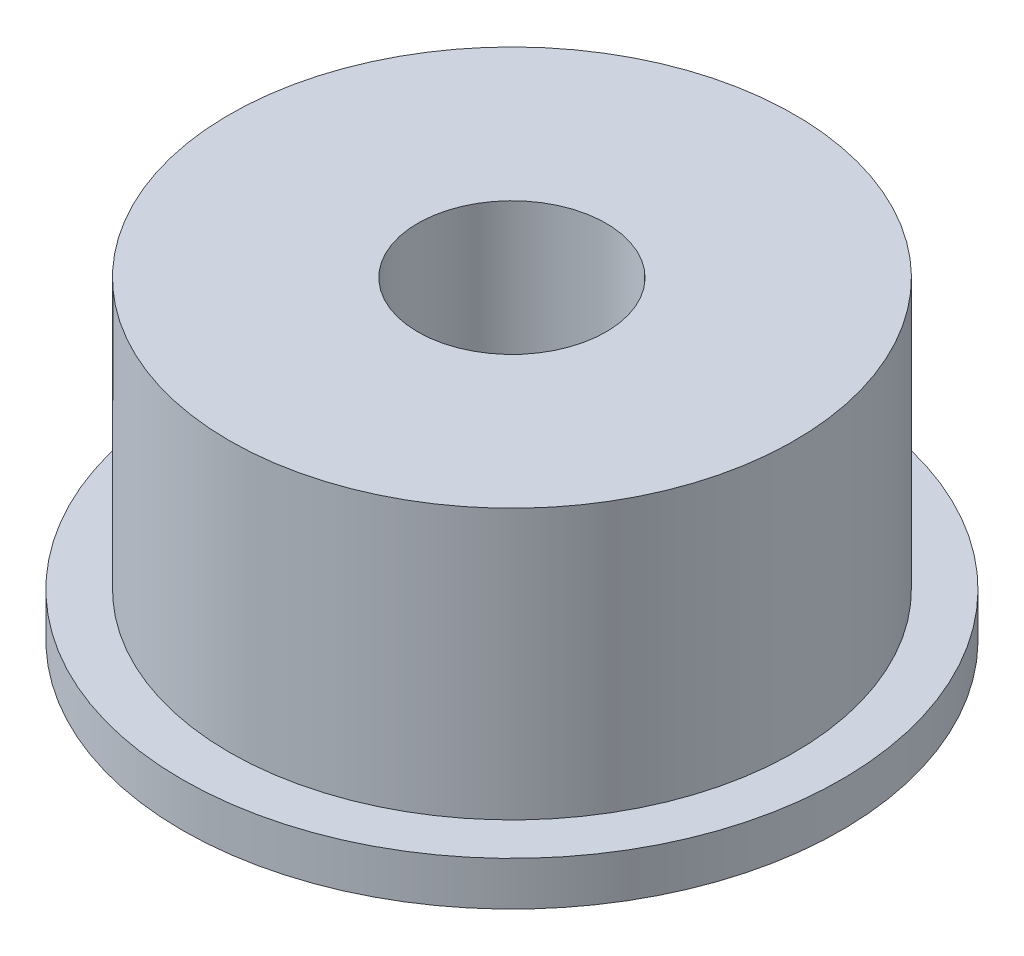
ISO-10303-21;
HEADER;
FILE_DESCRIPTION(('STEP AP214'),'2;1');
FILE_NAME('part.step','',(''),(''),'','','');
FILE_SCHEMA(('AUTOMOTIVE_DESIGN { 1 0 10303 214 1 1 1 1 }'));
ENDSEC;
DATA;
#1=APPLICATION_CONTEXT('core data for automotive mechanical design processes');
#2=APPLICATION_PROTOCOL_DEFINITION('international standard','automotive_design',2000,#1);
#3=PRODUCT_CONTEXT('',#1,'mechanical');
#4=PRODUCT('Part','Part','',(#3));
#5=PRODUCT_RELATED_PRODUCT_CATEGORY('part','',(#4));
#6=PRODUCT_DEFINITION_FORMATION('','',#4);
#7=PRODUCT_DEFINITION_CONTEXT('part definition',#1,'design');
#8=PRODUCT_DEFINITION('design','',#6,#7);
#9=PRODUCT_DEFINITION_SHAPE('','',#8);
#10=(LENGTH_UNIT() NAMED_UNIT(*) SI_UNIT(.MILLI.,.METRE.));
#11=(NAMED_UNIT(*) PLANE_ANGLE_UNIT() SI_UNIT($,.RADIAN.));
#12=(NAMED_UNIT(*) SI_UNIT($,.STERADIAN.) SOLID_ANGLE_UNIT());
#13=UNCERTAINTY_MEASURE_WITH_UNIT(LENGTH_MEASURE(1.E-05),#10,'distance_accuracy_value','');
#14=(GEOMETRIC_REPRESENTATION_CONTEXT(3) GLOBAL_UNCERTAINTY_ASSIGNED_CONTEXT((#13)) GLOBAL_UNIT_ASSIGNED_CONTEXT((#10,
#11,#12)) REPRESENTATION_CONTEXT('',''));
#15=CARTESIAN_POINT('',(0.,0.,0.));
#16=DIRECTION('',(0.,0.,1.));
#17=DIRECTION('',(1.,0.,0.));
#18=AXIS2_PLACEMENT_3D('',#15,#16,#17);
#19=CARTESIAN_POINT('',(0.,0.7,0.));
#20=DIRECTION('',(0.,-1.,0.));
#21=DIRECTION('',(0.,0.,-1.));
#22=AXIS2_PLACEMENT_3D('',#19,#20,#21);
#23=CYLINDRICAL_SURFACE('',#22,5.25);
#24=CARTESIAN_POINT('',(0.,0.7,0.));
#25=DIRECTION('',(0.,1.,0.));
#26=DIRECTION('',(0.,0.,1.));
#27=AXIS2_PLACEMENT_3D('',#24,#25,#26);
#28=CIRCLE('',#27,5.25);
#29=CARTESIAN_POINT('',(0.,0.7,5.25));
#30=VERTEX_POINT('',#29);
#31=EDGE_CURVE('E10',#30,#30,#28,.T.);
#32=ORIENTED_EDGE('',*,*,#31,.F.);
#33=EDGE_LOOP('',(#32));
#34=FACE_BOUND('',#33,.T.);
#35=CARTESIAN_POINT('',(0.,0.,0.));
#36=DIRECTION('',(0.,1.,0.));
#37=DIRECTION('',(0.,0.,1.));
#38=AXIS2_PLACEMENT_3D('',#35,#36,#37);
#39=CIRCLE('',#38,5.25);
#40=CARTESIAN_POINT('',(0.,0.,5.25));
#41=VERTEX_POINT('',#40);
#42=EDGE_CURVE('E38',#41,#41,#39,.T.);
#43=ORIENTED_EDGE('',*,*,#42,.T.);
#44=EDGE_LOOP('',(#43));
#45=FACE_BOUND('',#44,.T.);
#46=ADVANCED_FACE('F35',(#34,#45),#23,.T.);
#47=CARTESIAN_POINT('',(0.,0.7,0.));
#48=DIRECTION('',(0.,1.,0.));
#49=DIRECTION('',(0.,0.,1.));
#50=AXIS2_PLACEMENT_3D('',#47,#48,#49);
#51=PLANE('',#50);
#52=CARTESIAN_POINT('',(0.,0.7,0.));
#53=DIRECTION('',(0.,1.,0.));
#54=DIRECTION('',(0.,0.,1.));
#55=AXIS2_PLACEMENT_3D('',#52,#53,#54);
#56=CIRCLE('',#55,4.5);
#57=CARTESIAN_POINT('',(0.,0.7,4.5));
#58=VERTEX_POINT('',#57);
#59=EDGE_CURVE('E47',#58,#58,#56,.T.);
#60=ORIENTED_EDGE('',*,*,#59,.F.);
#61=EDGE_LOOP('',(#60));
#62=FACE_BOUND('',#61,.T.);
#63=ORIENTED_EDGE('',*,*,#31,.T.);
#64=EDGE_LOOP('',(#63));
#65=FACE_BOUND('',#64,.T.);
#66=ADVANCED_FACE('F80',(#62,#65),#51,.T.);
#67=CARTESIAN_POINT('',(0.,0.,0.));
#68=DIRECTION('',(0.,1.,0.));
#69=DIRECTION('',(0.,0.,1.));
#70=AXIS2_PLACEMENT_3D('',#67,#68,#69);
#71=PLANE('',#70);
#72=CARTESIAN_POINT('',(0.,0.,0.));
#73=DIRECTION('',(0.,1.,0.));
#74=DIRECTION('',(0.,0.,1.));
#75=AXIS2_PLACEMENT_3D('',#72,#73,#74);
#76=CIRCLE('',#75,1.5);
#77=CARTESIAN_POINT('',(0.,0.,1.5));
#78=VERTEX_POINT('',#77);
#79=EDGE_CURVE('E50',#78,#78,#76,.T.);
#80=ORIENTED_EDGE('',*,*,#79,.T.);
#81=EDGE_LOOP('',(#80));
#82=FACE_BOUND('',#81,.T.);
#83=ORIENTED_EDGE('',*,*,#42,.F.);
#84=EDGE_LOOP('',(#83));
#85=FACE_BOUND('',#84,.T.);
#86=ADVANCED_FACE('F59',(#82,#85),#71,.F.);
#87=CARTESIAN_POINT('',(0.,5.,0.));
#88=DIRECTION('',(0.,-1.,0.));
#89=DIRECTION('',(0.,0.,-1.));
#90=AXIS2_PLACEMENT_3D('',#87,#88,#89);
#91=CYLINDRICAL_SURFACE('',#90,4.5);
#92=CARTESIAN_POINT('',(0.,5.,0.));
#93=DIRECTION('',(0.,1.,0.));
#94=DIRECTION('',(0.,0.,1.));
#95=AXIS2_PLACEMENT_3D('',#92,#93,#94);
#96=CIRCLE('',#95,4.5);
#97=CARTESIAN_POINT('',(0.,5.,4.5));
#98=VERTEX_POINT('',#97);
#99=EDGE_CURVE('E45',#98,#98,#96,.T.);
#100=ORIENTED_EDGE('',*,*,#99,.F.);
#101=EDGE_LOOP('',(#100));
#102=FACE_BOUND('',#101,.T.);
#103=ORIENTED_EDGE('',*,*,#59,.T.);
#104=EDGE_LOOP('',(#103));
#105=FACE_BOUND('',#104,.T.);
#106=ADVANCED_FACE('F71',(#102,#105),#91,.T.);
#107=CARTESIAN_POINT('',(0.,5.,0.));
#108=DIRECTION('',(0.,1.,0.));
#109=DIRECTION('',(0.,0.,1.));
#110=AXIS2_PLACEMENT_3D('',#107,#108,#109);
#111=PLANE('',#110);
#112=CARTESIAN_POINT('',(0.,5.,0.));
#113=DIRECTION('',(0.,1.,0.));
#114=DIRECTION('',(0.,0.,1.));
#115=AXIS2_PLACEMENT_3D('',#112,#113,#114);
#116=CIRCLE('',#115,1.5);
#117=CARTESIAN_POINT('',(0.,5.,1.5));
#118=VERTEX_POINT('',#117);
#119=EDGE_CURVE('E53',#118,#118,#116,.T.);
#120=ORIENTED_EDGE('',*,*,#119,.F.);
#121=EDGE_LOOP('',(#120));
#122=FACE_BOUND('',#121,.T.);
#123=ORIENTED_EDGE('',*,*,#99,.T.);
#124=EDGE_LOOP('',(#123));
#125=FACE_BOUND('',#124,.T.);
#126=ADVANCED_FACE('F65',(#122,#125),#111,.T.);
#127=CARTESIAN_POINT('',(0.,0.,0.));
#128=DIRECTION('',(0.,1.,0.));
#129=DIRECTION('',(0.,0.,1.));
#130=AXIS2_PLACEMENT_3D('',#127,#128,#129);
#131=CYLINDRICAL_SURFACE('',#130,1.5);
#132=ORIENTED_EDGE('',*,*,#79,.F.);
#133=EDGE_LOOP('',(#132));
#134=FACE_BOUND('',#133,.T.);
#135=ORIENTED_EDGE('',*,*,#119,.T.);
#136=EDGE_LOOP('',(#135));
#137=FACE_BOUND('',#136,.T.);
#138=ADVANCED_FACE('F62',(#134,#137),#131,.F.);
#139=CLOSED_SHELL('',(#46,#66,#86,#106,#126,#138));
#140=MANIFOLD_SOLID_BREP('B2',#139);
#141=ADVANCED_BREP_SHAPE_REPRESENTATION('',(#18,#140),#14);
#142=SHAPE_DEFINITION_REPRESENTATION(#9,#141);
ENDSEC;
END-ISO-10303-21;
